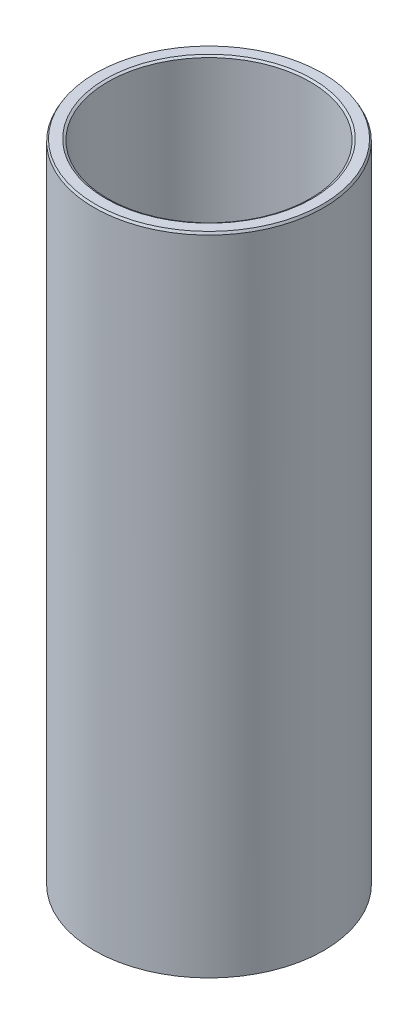
ISO-10303-21;
HEADER;
FILE_DESCRIPTION(('STEP AP214'),'2;1');
FILE_NAME('part.step','',(''),(''),'','','');
FILE_SCHEMA(('AUTOMOTIVE_DESIGN { 1 0 10303 214 1 1 1 1 }'));
ENDSEC;
DATA;
#1=APPLICATION_CONTEXT('core data for automotive mechanical design processes');
#2=APPLICATION_PROTOCOL_DEFINITION('international standard','automotive_design',2000,#1);
#3=PRODUCT_CONTEXT('',#1,'mechanical');
#4=PRODUCT('Part','Part','',(#3));
#5=PRODUCT_RELATED_PRODUCT_CATEGORY('part','',(#4));
#6=PRODUCT_DEFINITION_FORMATION('','',#4);
#7=PRODUCT_DEFINITION_CONTEXT('part definition',#1,'design');
#8=PRODUCT_DEFINITION('design','',#6,#7);
#9=PRODUCT_DEFINITION_SHAPE('','',#8);
#10=(LENGTH_UNIT() NAMED_UNIT(*) SI_UNIT(.MILLI.,.METRE.));
#11=(NAMED_UNIT(*) PLANE_ANGLE_UNIT() SI_UNIT($,.RADIAN.));
#12=(NAMED_UNIT(*) SI_UNIT($,.STERADIAN.) SOLID_ANGLE_UNIT());
#13=UNCERTAINTY_MEASURE_WITH_UNIT(LENGTH_MEASURE(1.E-05),#10,'distance_accuracy_value','');
#14=(GEOMETRIC_REPRESENTATION_CONTEXT(3) GLOBAL_UNCERTAINTY_ASSIGNED_CONTEXT((#13)) GLOBAL_UNIT_ASSIGNED_CONTEXT((#10,
#11,#12)) REPRESENTATION_CONTEXT('',''));
#15=CARTESIAN_POINT('',(0.,0.,0.));
#16=DIRECTION('',(0.,0.,1.));
#17=DIRECTION('',(1.,0.,0.));
#18=AXIS2_PLACEMENT_3D('',#15,#16,#17);
#19=CARTESIAN_POINT('',(0.,211.182257399689,0.));
#20=DIRECTION('',(0.,-1.,0.));
#21=DIRECTION('',(0.,0.,-1.));
#22=AXIS2_PLACEMENT_3D('',#19,#20,#21);
#23=CYLINDRICAL_SURFACE('',#22,37.5);
#24=CARTESIAN_POINT('',(0.,0.430444316704304,0.));
#25=DIRECTION('',(0.,1.,0.));
#26=DIRECTION('',(0.,0.,1.));
#27=AXIS2_PLACEMENT_3D('',#24,#25,#26);
#28=CIRCLE('',#27,37.5);
#29=CARTESIAN_POINT('',(0.,0.430444316704276,-37.5));
#30=VERTEX_POINT('',#29);
#31=EDGE_CURVE('E10',#30,#30,#28,.T.);
#32=CARTESIAN_POINT('',(0.,210.436705973329,0.));
#33=DIRECTION('',(0.,1.,0.));
#34=DIRECTION('',(0.,0.,1.));
#35=AXIS2_PLACEMENT_3D('',#32,#33,#34);
#36=CIRCLE('',#35,37.5);
#37=CARTESIAN_POINT('',(0.,210.436705973329,-37.5));
#38=VERTEX_POINT('',#37);
#39=EDGE_CURVE('E50',#38,#38,#36,.F.);
#40=CARTESIAN_POINT('',(0.,0.430444316704276,-37.5));
#41=CARTESIAN_POINT('',(0.,2.61800954229411,-37.5));
#42=CARTESIAN_POINT('',(0.,4.80557476788395,-37.5));
#43=CARTESIAN_POINT('',(0.,9.18070521906362,-37.5));
#44=CARTESIAN_POINT('',(0.,11.3682704446535,-37.5));
#45=CARTESIAN_POINT('',(0.,15.7434008958331,-37.5));
#46=CARTESIAN_POINT('',(0.,17.930966121423,-37.5));
#47=CARTESIAN_POINT('',(0.,22.3060965726026,-37.5));
#48=CARTESIAN_POINT('',(0.,24.4936617981925,-37.5));
#49=CARTESIAN_POINT('',(0.,28.8687922493721,-37.5));
#50=CARTESIAN_POINT('',(0.,31.056357474962,-37.5));
#51=CARTESIAN_POINT('',(0.,35.4314879261417,-37.5));
#52=CARTESIAN_POINT('',(0.,37.6190531517315,-37.5));
#53=CARTESIAN_POINT('',(0.,41.9941836029112,-37.5));
#54=CARTESIAN_POINT('',(0.,44.181748828501,-37.5));
#55=CARTESIAN_POINT('',(0.,48.5568792796807,-37.5));
#56=CARTESIAN_POINT('',(0.,50.7444445052705,-37.5));
#57=CARTESIAN_POINT('',(0.,55.1195749564502,-37.5));
#58=CARTESIAN_POINT('',(0.,57.30714018204,-37.5));
#59=CARTESIAN_POINT('',(0.,61.6822706332197,-37.5));
#60=CARTESIAN_POINT('',(0.,63.8698358588095,-37.5));
#61=CARTESIAN_POINT('',(0.,68.2449663099892,-37.5));
#62=CARTESIAN_POINT('',(0.,70.432531535579,-37.5));
#63=CARTESIAN_POINT('',(0.,74.8076619867587,-37.5));
#64=CARTESIAN_POINT('',(0.,76.9952272123485,-37.5));
#65=CARTESIAN_POINT('',(0.,81.3703576635282,-37.5));
#66=CARTESIAN_POINT('',(0.,83.557922889118,-37.5));
#67=CARTESIAN_POINT('',(0.,87.9330533402977,-37.5));
#68=CARTESIAN_POINT('',(0.,90.1206185658875,-37.5));
#69=CARTESIAN_POINT('',(0.,94.4957490170672,-37.5));
#70=CARTESIAN_POINT('',(0.,96.683314242657,-37.5));
#71=CARTESIAN_POINT('',(0.,101.058444693837,-37.5));
#72=CARTESIAN_POINT('',(0.,103.246009919427,-37.5));
#73=CARTESIAN_POINT('',(0.,107.621140370606,-37.5));
#74=CARTESIAN_POINT('',(0.,109.808705596196,-37.5));
#75=CARTESIAN_POINT('',(0.,114.183836047376,-37.5));
#76=CARTESIAN_POINT('',(0.,116.371401272966,-37.5));
#77=CARTESIAN_POINT('',(0.,120.746531724145,-37.5));
#78=CARTESIAN_POINT('',(0.,122.934096949735,-37.5));
#79=CARTESIAN_POINT('',(0.,127.309227400915,-37.5));
#80=CARTESIAN_POINT('',(0.,129.496792626505,-37.5));
#81=CARTESIAN_POINT('',(0.,133.871923077684,-37.5));
#82=CARTESIAN_POINT('',(0.,136.059488303274,-37.5));
#83=CARTESIAN_POINT('',(0.,140.434618754454,-37.5));
#84=CARTESIAN_POINT('',(0.,142.622183980044,-37.5));
#85=CARTESIAN_POINT('',(0.,146.997314431223,-37.5));
#86=CARTESIAN_POINT('',(0.,149.184879656813,-37.5));
#87=CARTESIAN_POINT('',(0.,153.560010107993,-37.5));
#88=CARTESIAN_POINT('',(0.,155.747575333583,-37.5));
#89=CARTESIAN_POINT('',(0.,160.122705784762,-37.5));
#90=CARTESIAN_POINT('',(0.,162.310271010352,-37.5));
#91=CARTESIAN_POINT('',(0.,166.685401461532,-37.5));
#92=CARTESIAN_POINT('',(0.,168.872966687122,-37.5));
#93=CARTESIAN_POINT('',(0.,173.248097138301,-37.5));
#94=CARTESIAN_POINT('',(0.,175.435662363891,-37.5));
#95=CARTESIAN_POINT('',(0.,179.810792815071,-37.5));
#96=CARTESIAN_POINT('',(0.,181.998358040661,-37.5));
#97=CARTESIAN_POINT('',(0.,186.37348849184,-37.5));
#98=CARTESIAN_POINT('',(0.,188.56105371743,-37.5));
#99=CARTESIAN_POINT('',(0.,192.93618416861,-37.5));
#100=CARTESIAN_POINT('',(0.,195.1237493942,-37.5));
#101=CARTESIAN_POINT('',(0.,199.498879845379,-37.5));
#102=CARTESIAN_POINT('',(0.,201.686445070969,-37.5));
#103=CARTESIAN_POINT('',(0.,206.061575522149,-37.5));
#104=CARTESIAN_POINT('',(0.,208.249140747739,-37.5));
#105=CARTESIAN_POINT('',(0.,210.436705973329,-37.5));
#106=B_SPLINE_CURVE_WITH_KNOTS('',3,(#40,#41,#42,#43,#44,#45,#46,#47,#48,#49,#50,#51,#52,#53,
#54,#55,#56,#57,#58,#59,#60,#61,#62,#63,#64,#65,#66,#67,#68,#69,#70,#71,#72,#73,#74,#75,#76,#77,
#78,#79,#80,#81,#82,#83,#84,#85,#86,#87,#88,#89,#90,#91,#92,#93,#94,#95,#96,#97,#98,#99,#100,
#101,#102,#103,#104,#105),.UNSPECIFIED.,.F.,.F.,(4,2,2,2,2,2,2,2,2,2,2,2,2,2,2,2,2,2,2,2,2,2,2,
2,2,2,2,2,2,2,2,2,4),(0.,6.56269567676951,13.125391353539,19.6880870303085,26.250782707078,
32.8134783838475,39.3761740606171,45.9388697373866,52.5015654141561,59.0642610909256,
65.6269567676951,72.1896524444646,78.7523481212341,85.3150437980036,91.8777394747731,
98.4404351515426,105.003130828312,111.565826505082,118.128522181851,124.691217858621,
131.25391353539,137.81660921216,144.379304888929,150.942000565699,157.504696242468,
164.067391919238,170.630087596007,177.192783272777,183.755478949546,190.318174626316,
196.880870303085,203.443565979855,210.006261656624),.UNSPECIFIED.);
#107=EDGE_CURVE('BSEAM39',#30,#38,#106,.T.);
#108=ORIENTED_EDGE('',*,*,#31,.T.);
#109=ORIENTED_EDGE('',*,*,#39,.T.);
#110=ORIENTED_EDGE('',*,*,#107,.T.);
#111=ORIENTED_EDGE('',*,*,#107,.F.);
#112=EDGE_LOOP('',(#108,#110,#109,#111));
#113=FACE_BOUND('',#112,.T.);
#114=ADVANCED_FACE('F39',(#113),#23,.T.);
#115=CARTESIAN_POINT('',(0.,211.182257399689,0.));
#116=DIRECTION('',(0.,1.,0.));
#117=DIRECTION('',(0.,0.,1.));
#118=AXIS2_PLACEMENT_3D('',#115,#116,#117);
#119=PLANE('',#118);
#120=CARTESIAN_POINT('',(0.,211.182257399689,0.));
#121=DIRECTION('',(0.,1.,0.));
#122=DIRECTION('',(0.,0.,1.));
#123=AXIS2_PLACEMENT_3D('',#120,#121,#122);
#124=CIRCLE('',#123,33.7889442821488);
#125=CARTESIAN_POINT('',(0.,211.182257399689,33.7889442821488));
#126=VERTEX_POINT('',#125);
#127=EDGE_CURVE('E58',#126,#126,#124,.F.);
#128=ORIENTED_EDGE('',*,*,#127,.T.);
#129=EDGE_LOOP('',(#128));
#130=FACE_BOUND('',#129,.T.);
#131=CARTESIAN_POINT('',(0.,211.182257399689,0.));
#132=DIRECTION('',(0.,1.,0.));
#133=DIRECTION('',(0.,0.,1.));
#134=AXIS2_PLACEMENT_3D('',#131,#132,#133);
#135=CIRCLE('',#134,37.0695556832958);
#136=CARTESIAN_POINT('',(0.,211.182257399689,37.0695556832958));
#137=VERTEX_POINT('',#136);
#138=EDGE_CURVE('E61',#137,#137,#135,.T.);
#139=ORIENTED_EDGE('',*,*,#138,.T.);
#140=EDGE_LOOP('',(#139));
#141=FACE_BOUND('',#140,.T.);
#142=ADVANCED_FACE('F88',(#130,#141),#119,.T.);
#143=CARTESIAN_POINT('',(0.,0.,0.));
#144=DIRECTION('',(0.,1.,0.));
#145=DIRECTION('',(0.,0.,1.));
#146=AXIS2_PLACEMENT_3D('',#143,#144,#145);
#147=PLANE('',#146);
#148=CARTESIAN_POINT('',(0.,0.,0.));
#149=DIRECTION('',(0.,1.,0.));
#150=DIRECTION('',(0.,0.,1.));
#151=AXIS2_PLACEMENT_3D('',#148,#149,#150);
#152=CIRCLE('',#151,33.4738371724919);
#153=CARTESIAN_POINT('',(0.,0.,33.4738371724919));
#154=VERTEX_POINT('',#153);
#155=EDGE_CURVE('E51',#154,#154,#152,.T.);
#156=ORIENTED_EDGE('',*,*,#155,.T.);
#157=EDGE_LOOP('',(#156));
#158=FACE_BOUND('',#157,.T.);
#159=CARTESIAN_POINT('',(0.,0.,0.));
#160=DIRECTION('',(0.,1.,0.));
#161=DIRECTION('',(0.,0.,1.));
#162=AXIS2_PLACEMENT_3D('',#159,#160,#161);
#163=CIRCLE('',#162,36.7544485736388);
#164=CARTESIAN_POINT('',(0.,0.,36.7544485736388));
#165=VERTEX_POINT('',#164);
#166=EDGE_CURVE('E54',#165,#165,#163,.F.);
#167=ORIENTED_EDGE('',*,*,#166,.T.);
#168=EDGE_LOOP('',(#167));
#169=FACE_BOUND('',#168,.T.);
#170=ADVANCED_FACE('F83',(#158,#169),#147,.F.);
#171=CARTESIAN_POINT('',(0.,211.182257399689,0.));
#172=DIRECTION('',(0.,-1.,0.));
#173=DIRECTION('',(0.,0.,-1.));
#174=AXIS2_PLACEMENT_3D('',#171,#172,#173);
#175=CYLINDRICAL_SURFACE('',#174,33.0433928557877);
#176=CARTESIAN_POINT('',(0.,210.751813082985,0.));
#177=DIRECTION('',(0.,1.,0.));
#178=DIRECTION('',(0.,0.,1.));
#179=AXIS2_PLACEMENT_3D('',#176,#177,#178);
#180=CIRCLE('',#179,33.0433928557877);
#181=CARTESIAN_POINT('',(0.,210.751813082985,-33.0433928557877));
#182=VERTEX_POINT('',#181);
#183=EDGE_CURVE('E67',#182,#182,#180,.T.);
#184=CARTESIAN_POINT('',(0.,0.745551426360985,0.));
#185=DIRECTION('',(0.,1.,0.));
#186=DIRECTION('',(0.,0.,1.));
#187=AXIS2_PLACEMENT_3D('',#184,#185,#186);
#188=CIRCLE('',#187,33.0433928557877);
#189=CARTESIAN_POINT('',(0.,0.745551426360985,-33.0433928557877));
#190=VERTEX_POINT('',#189);
#191=EDGE_CURVE('E69',#190,#190,#188,.F.);
#192=CARTESIAN_POINT('',(0.,210.751813082985,-33.0433928557877));
#193=CARTESIAN_POINT('',(0.,208.564247857395,-33.0433928557877));
#194=CARTESIAN_POINT('',(0.,206.376682631806,-33.0433928557877));
#195=CARTESIAN_POINT('',(0.,202.001552180626,-33.0433928557877));
#196=CARTESIAN_POINT('',(0.,199.813986955036,-33.0433928557877));
#197=CARTESIAN_POINT('',(0.,195.438856503856,-33.0433928557877));
#198=CARTESIAN_POINT('',(0.,193.251291278267,-33.0433928557877));
#199=CARTESIAN_POINT('',(0.,188.876160827087,-33.0433928557877));
#200=CARTESIAN_POINT('',(0.,186.688595601497,-33.0433928557877));
#201=CARTESIAN_POINT('',(0.,182.313465150317,-33.0433928557877));
#202=CARTESIAN_POINT('',(0.,180.125899924727,-33.0433928557877));
#203=CARTESIAN_POINT('',(0.,175.750769473548,-33.0433928557877));
#204=CARTESIAN_POINT('',(0.,173.563204247958,-33.0433928557877));
#205=CARTESIAN_POINT('',(0.,169.188073796778,-33.0433928557877));
#206=CARTESIAN_POINT('',(0.,167.000508571188,-33.0433928557877));
#207=CARTESIAN_POINT('',(0.,162.625378120009,-33.0433928557877));
#208=CARTESIAN_POINT('',(0.,160.437812894419,-33.0433928557877));
#209=CARTESIAN_POINT('',(0.,156.062682443239,-33.0433928557877));
#210=CARTESIAN_POINT('',(0.,153.875117217649,-33.0433928557877));
#211=CARTESIAN_POINT('',(0.,149.49998676647,-33.0433928557877));
#212=CARTESIAN_POINT('',(0.,147.31242154088,-33.0433928557877));
#213=CARTESIAN_POINT('',(0.,142.9372910897,-33.0433928557877));
#214=CARTESIAN_POINT('',(0.,140.74972586411,-33.0433928557877));
#215=CARTESIAN_POINT('',(0.,136.374595412931,-33.0433928557877));
#216=CARTESIAN_POINT('',(0.,134.187030187341,-33.0433928557877));
#217=CARTESIAN_POINT('',(0.,129.811899736161,-33.0433928557877));
#218=CARTESIAN_POINT('',(0.,127.624334510571,-33.0433928557877));
#219=CARTESIAN_POINT('',(0.,123.249204059392,-33.0433928557877));
#220=CARTESIAN_POINT('',(0.,121.061638833802,-33.0433928557877));
#221=CARTESIAN_POINT('',(0.,116.686508382622,-33.0433928557877));
#222=CARTESIAN_POINT('',(0.,114.498943157032,-33.0433928557877));
#223=CARTESIAN_POINT('',(0.,110.123812705853,-33.0433928557877));
#224=CARTESIAN_POINT('',(0.,107.936247480263,-33.0433928557877));
#225=CARTESIAN_POINT('',(0.,103.561117029083,-33.0433928557877));
#226=CARTESIAN_POINT('',(0.,101.373551803493,-33.0433928557877));
#227=CARTESIAN_POINT('',(0.,96.9984213523138,-33.0433928557877));
#228=CARTESIAN_POINT('',(0.,94.8108561267239,-33.0433928557877));
#229=CARTESIAN_POINT('',(0.,90.4357256755442,-33.0433928557877));
#230=CARTESIAN_POINT('',(0.,88.2481604499544,-33.0433928557877));
#231=CARTESIAN_POINT('',(0.,83.8730299987747,-33.0433928557877));
#232=CARTESIAN_POINT('',(0.,81.6854647731849,-33.0433928557877));
#233=CARTESIAN_POINT('',(0.,77.3103343220052,-33.0433928557877));
#234=CARTESIAN_POINT('',(0.,75.1227690964154,-33.0433928557877));
#235=CARTESIAN_POINT('',(0.,70.7476386452357,-33.0433928557877));
#236=CARTESIAN_POINT('',(0.,68.5600734196459,-33.0433928557877));
#237=CARTESIAN_POINT('',(0.,64.1849429684662,-33.0433928557877));
#238=CARTESIAN_POINT('',(0.,61.9973777428764,-33.0433928557877));
#239=CARTESIAN_POINT('',(0.,57.6222472916967,-33.0433928557877));
#240=CARTESIAN_POINT('',(0.,55.4346820661069,-33.0433928557877));
#241=CARTESIAN_POINT('',(0.,51.0595516149272,-33.0433928557877));
#242=CARTESIAN_POINT('',(0.,48.8719863893374,-33.0433928557877));
#243=CARTESIAN_POINT('',(0.,44.4968559381577,-33.0433928557877));
#244=CARTESIAN_POINT('',(0.,42.3092907125679,-33.0433928557877));
#245=CARTESIAN_POINT('',(0.,37.9341602613882,-33.0433928557877));
#246=CARTESIAN_POINT('',(0.,35.7465950357984,-33.0433928557877));
#247=CARTESIAN_POINT('',(0.,31.3714645846187,-33.0433928557877));
#248=CARTESIAN_POINT('',(0.,29.1838993590289,-33.0433928557877));
#249=CARTESIAN_POINT('',(0.,24.8087689078492,-33.0433928557877));
#250=CARTESIAN_POINT('',(0.,22.6212036822594,-33.0433928557877));
#251=CARTESIAN_POINT('',(0.,18.2460732310797,-33.0433928557877));
#252=CARTESIAN_POINT('',(0.,16.0585080054898,-33.0433928557877));
#253=CARTESIAN_POINT('',(0.,11.6833775543102,-33.0433928557877));
#254=CARTESIAN_POINT('',(0.,9.49581232872035,-33.0433928557877));
#255=CARTESIAN_POINT('',(0.,5.12068187754068,-33.0433928557877));
#256=CARTESIAN_POINT('',(0.,2.93311665195083,-33.0433928557877));
#257=CARTESIAN_POINT('',(0.,0.745551426360985,-33.0433928557877));
#258=B_SPLINE_CURVE_WITH_KNOTS('',3,(#192,#193,#194,#195,#196,#197,#198,#199,#200,#201,#202,
#203,#204,#205,#206,#207,#208,#209,#210,#211,#212,#213,#214,#215,#216,#217,#218,#219,#220,#221,
#222,#223,#224,#225,#226,#227,#228,#229,#230,#231,#232,#233,#234,#235,#236,#237,#238,#239,#240,
#241,#242,#243,#244,#245,#246,#247,#248,#249,#250,#251,#252,#253,#254,#255,#256,#257),
.UNSPECIFIED.,.F.,.F.,(4,2,2,2,2,2,2,2,2,2,2,2,2,2,2,2,2,2,2,2,2,2,2,2,2,2,2,2,2,2,2,2,4),(0.,
6.56269567676951,13.125391353539,19.6880870303085,26.250782707078,32.8134783838475,
39.3761740606171,45.9388697373866,52.5015654141561,59.0642610909256,65.6269567676951,
72.1896524444646,78.7523481212341,85.3150437980036,91.8777394747731,98.4404351515426,
105.003130828312,111.565826505082,118.128522181851,124.691217858621,131.25391353539,
137.81660921216,144.379304888929,150.942000565699,157.504696242468,164.067391919238,
170.630087596007,177.192783272777,183.755478949546,190.318174626316,196.880870303085,
203.443565979855,210.006261656624),.UNSPECIFIED.);
#259=EDGE_CURVE('BSEAM71',#182,#190,#258,.T.);
#260=ORIENTED_EDGE('',*,*,#183,.T.);
#261=ORIENTED_EDGE('',*,*,#191,.T.);
#262=ORIENTED_EDGE('',*,*,#259,.T.);
#263=ORIENTED_EDGE('',*,*,#259,.F.);
#264=EDGE_LOOP('',(#260,#262,#261,#263));
#265=FACE_BOUND('',#264,.T.);
#266=ADVANCED_FACE('F71',(#265),#175,.F.);
#267=CARTESIAN_POINT('',(0.,210.751813082985,0.));
#268=DIRECTION('',(0.,1.,0.));
#269=DIRECTION('',(0.,0.,1.));
#270=AXIS2_PLACEMENT_3D('',#267,#268,#269);
#271=CONICAL_SURFACE('',#270,33.0433928557877,1.04719755119661);
#272=ORIENTED_EDGE('',*,*,#127,.F.);
#273=EDGE_LOOP('',(#272));
#274=FACE_BOUND('',#273,.T.);
#275=ORIENTED_EDGE('',*,*,#183,.F.);
#276=EDGE_LOOP('',(#275));
#277=FACE_BOUND('',#276,.T.);
#278=ADVANCED_FACE('F77',(#274,#277),#271,.F.);
#279=CARTESIAN_POINT('',(0.,0.,0.));
#280=DIRECTION('',(0.,-1.,0.));
#281=DIRECTION('',(0.,0.,-1.));
#282=AXIS2_PLACEMENT_3D('',#279,#280,#281);
#283=CONICAL_SURFACE('',#282,33.4738371724919,0.523598775598267);
#284=ORIENTED_EDGE('',*,*,#191,.F.);
#285=EDGE_LOOP('',(#284));
#286=FACE_BOUND('',#285,.T.);
#287=ORIENTED_EDGE('',*,*,#155,.F.);
#288=EDGE_LOOP('',(#287));
#289=FACE_BOUND('',#288,.T.);
#290=ADVANCED_FACE('F73',(#286,#289),#283,.F.);
#291=CARTESIAN_POINT('',(0.,0.430444316704304,0.));
#292=DIRECTION('',(0.,1.,0.));
#293=DIRECTION('',(0.,0.,1.));
#294=AXIS2_PLACEMENT_3D('',#291,#292,#293);
#295=CONICAL_SURFACE('',#294,37.5,1.04719755119663);
#296=ORIENTED_EDGE('',*,*,#166,.F.);
#297=EDGE_LOOP('',(#296));
#298=FACE_BOUND('',#297,.T.);
#299=ORIENTED_EDGE('',*,*,#31,.F.);
#300=EDGE_LOOP('',(#299));
#301=FACE_BOUND('',#300,.T.);
#302=ADVANCED_FACE('F76',(#298,#301),#295,.T.);
#303=CARTESIAN_POINT('',(0.,211.182257399689,0.));
#304=DIRECTION('',(0.,-1.,0.));
#305=DIRECTION('',(0.,0.,-1.));
#306=AXIS2_PLACEMENT_3D('',#303,#304,#305);
#307=CONICAL_SURFACE('',#306,37.0695556832958,0.523598775598297);
#308=ORIENTED_EDGE('',*,*,#39,.F.);
#309=EDGE_LOOP('',(#308));
#310=FACE_BOUND('',#309,.T.);
#311=ORIENTED_EDGE('',*,*,#138,.F.);
#312=EDGE_LOOP('',(#311));
#313=FACE_BOUND('',#312,.T.);
#314=ADVANCED_FACE('F45',(#310,#313),#307,.T.);
#315=CLOSED_SHELL('',(#114,#142,#170,#266,#278,#290,#302,#314));
#316=MANIFOLD_SOLID_BREP('B2',#315);
#317=ADVANCED_BREP_SHAPE_REPRESENTATION('',(#18,#316),#14);
#318=SHAPE_DEFINITION_REPRESENTATION(#9,#317);
ENDSEC;
END-ISO-10303-21;
